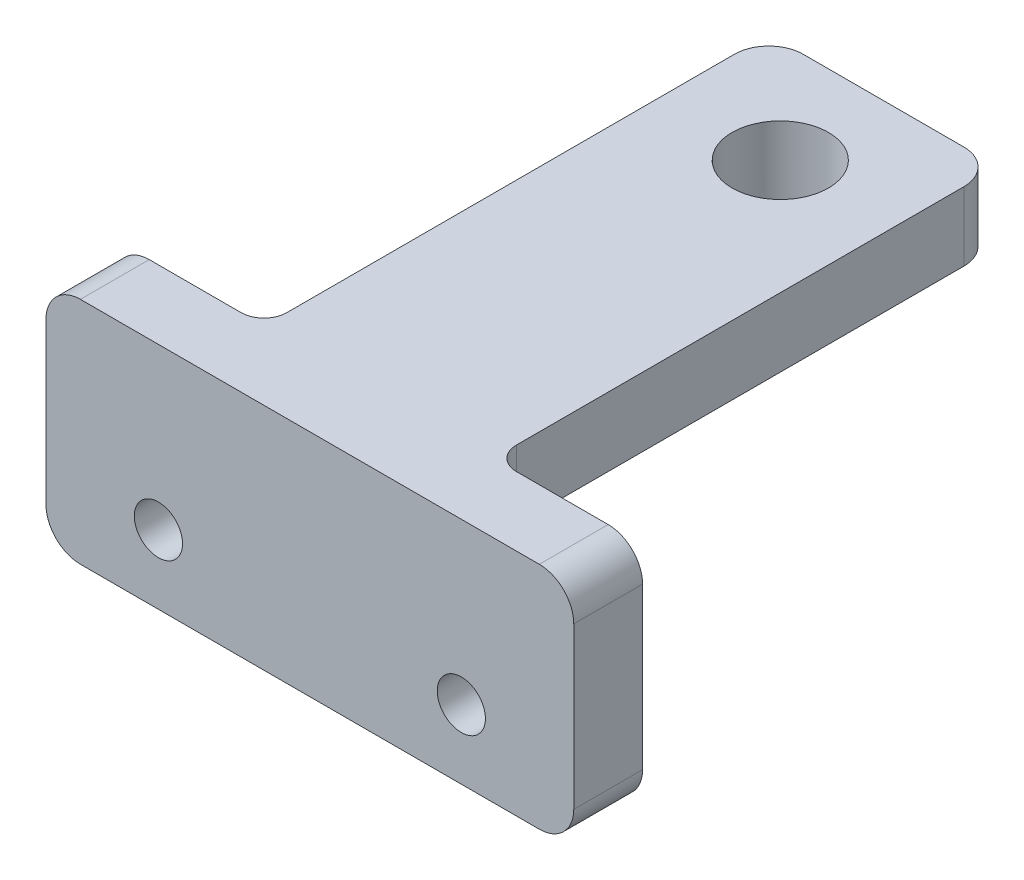
ISO-10303-21;
HEADER;
FILE_DESCRIPTION(('STEP AP214'),'2;1');
FILE_NAME('part.step','',(''),(''),'','','');
FILE_SCHEMA(('AUTOMOTIVE_DESIGN { 1 0 10303 214 1 1 1 1 }'));
ENDSEC;
DATA;
#1=APPLICATION_CONTEXT('core data for automotive mechanical design processes');
#2=APPLICATION_PROTOCOL_DEFINITION('international standard','automotive_design',2000,#1);
#3=PRODUCT_CONTEXT('',#1,'mechanical');
#4=PRODUCT('Part','Part','',(#3));
#5=PRODUCT_RELATED_PRODUCT_CATEGORY('part','',(#4));
#6=PRODUCT_DEFINITION_FORMATION('','',#4);
#7=PRODUCT_DEFINITION_CONTEXT('part definition',#1,'design');
#8=PRODUCT_DEFINITION('design','',#6,#7);
#9=PRODUCT_DEFINITION_SHAPE('','',#8);
#10=(LENGTH_UNIT() NAMED_UNIT(*) SI_UNIT(.MILLI.,.METRE.));
#11=(NAMED_UNIT(*) PLANE_ANGLE_UNIT() SI_UNIT($,.RADIAN.));
#12=(NAMED_UNIT(*) SI_UNIT($,.STERADIAN.) SOLID_ANGLE_UNIT());
#13=UNCERTAINTY_MEASURE_WITH_UNIT(LENGTH_MEASURE(1.E-05),#10,'distance_accuracy_value','');
#14=(GEOMETRIC_REPRESENTATION_CONTEXT(3) GLOBAL_UNCERTAINTY_ASSIGNED_CONTEXT((#13)) GLOBAL_UNIT_ASSIGNED_CONTEXT((#10,
#11,#12)) REPRESENTATION_CONTEXT('',''));
#15=CARTESIAN_POINT('',(0.,0.,0.));
#16=DIRECTION('',(0.,0.,1.));
#17=DIRECTION('',(1.,0.,0.));
#18=AXIS2_PLACEMENT_3D('',#15,#16,#17);
#19=CARTESIAN_POINT('',(0.,0.,3.));
#20=DIRECTION('',(0.,0.,-1.));
#21=DIRECTION('',(-1.,0.,0.));
#22=AXIS2_PLACEMENT_3D('',#19,#20,#21);
#23=PLANE('',#22);
#24=DIRECTION('',(0.,-1.,0.));
#25=VECTOR('',#24,1.);
#26=CARTESIAN_POINT('',(0.,0.,3.));
#27=LINE('',#26,#25);
#28=CARTESIAN_POINT('',(0.,8.5,3.));
#29=VERTEX_POINT('',#28);
#30=CARTESIAN_POINT('',(0.,1.5,3.));
#31=VERTEX_POINT('',#30);
#32=EDGE_CURVE('E194',#29,#31,#27,.T.);
#33=ORIENTED_EDGE('',*,*,#32,.T.);
#34=CARTESIAN_POINT('',(1.5,1.5,3.));
#35=DIRECTION('',(0.,0.,-1.));
#36=DIRECTION('',(-1.,0.,0.));
#37=AXIS2_PLACEMENT_3D('',#34,#35,#36);
#38=CIRCLE('',#37,1.5);
#39=CARTESIAN_POINT('',(1.5,0.,3.));
#40=VERTEX_POINT('',#39);
#41=EDGE_CURVE('E216',#31,#40,#38,.F.);
#42=ORIENTED_EDGE('',*,*,#41,.T.);
#43=DIRECTION('',(1.,0.,0.));
#44=VECTOR('',#43,1.);
#45=CARTESIAN_POINT('',(0.,0.,3.));
#46=LINE('',#45,#44);
#47=CARTESIAN_POINT('',(21.5,0.,3.));
#48=VERTEX_POINT('',#47);
#49=EDGE_CURVE('E174',#40,#48,#46,.T.);
#50=ORIENTED_EDGE('',*,*,#49,.T.);
#51=CARTESIAN_POINT('',(21.5,1.5,3.));
#52=DIRECTION('',(0.,0.,-1.));
#53=DIRECTION('',(-1.,0.,0.));
#54=AXIS2_PLACEMENT_3D('',#51,#52,#53);
#55=CIRCLE('',#54,1.5);
#56=CARTESIAN_POINT('',(23.,1.5,3.));
#57=VERTEX_POINT('',#56);
#58=EDGE_CURVE('E214',#48,#57,#55,.F.);
#59=ORIENTED_EDGE('',*,*,#58,.T.);
#60=DIRECTION('',(0.,1.,0.));
#61=VECTOR('',#60,1.);
#62=CARTESIAN_POINT('',(23.,0.,3.));
#63=LINE('',#62,#61);
#64=CARTESIAN_POINT('',(23.,8.5,3.));
#65=VERTEX_POINT('',#64);
#66=EDGE_CURVE('E298',#57,#65,#63,.T.);
#67=ORIENTED_EDGE('',*,*,#66,.T.);
#68=CARTESIAN_POINT('',(21.5,8.5,3.));
#69=DIRECTION('',(0.,0.,-1.));
#70=DIRECTION('',(-1.,0.,0.));
#71=AXIS2_PLACEMENT_3D('',#68,#69,#70);
#72=CIRCLE('',#71,1.5);
#73=CARTESIAN_POINT('',(21.5,10.,3.));
#74=VERTEX_POINT('',#73);
#75=EDGE_CURVE('E212',#65,#74,#72,.F.);
#76=ORIENTED_EDGE('',*,*,#75,.T.);
#77=DIRECTION('',(-1.,0.,0.));
#78=VECTOR('',#77,1.);
#79=CARTESIAN_POINT('',(0.,10.,3.));
#80=LINE('',#79,#78);
#81=CARTESIAN_POINT('',(1.5,10.,3.));
#82=VERTEX_POINT('',#81);
#83=EDGE_CURVE('E200',#74,#82,#80,.T.);
#84=ORIENTED_EDGE('',*,*,#83,.T.);
#85=CARTESIAN_POINT('',(1.5,8.5,3.));
#86=DIRECTION('',(0.,0.,-1.));
#87=DIRECTION('',(-1.,0.,0.));
#88=AXIS2_PLACEMENT_3D('',#85,#86,#87);
#89=CIRCLE('',#88,1.5);
#90=EDGE_CURVE('E210',#82,#29,#89,.F.);
#91=ORIENTED_EDGE('',*,*,#90,.T.);
#92=EDGE_LOOP('',(#33,#42,#50,#59,#67,#76,#84,#91));
#93=FACE_BOUND('',#92,.T.);
#94=CARTESIAN_POINT('',(4.9,3.,3.));
#95=DIRECTION('',(0.,0.,1.));
#96=DIRECTION('',(1.,0.,0.));
#97=AXIS2_PLACEMENT_3D('',#94,#95,#96);
#98=CIRCLE('',#97,1.05);
#99=CARTESIAN_POINT('',(5.95,3.,3.));
#100=VERTEX_POINT('',#99);
#101=EDGE_CURVE('E188',#100,#100,#98,.T.);
#102=ORIENTED_EDGE('',*,*,#101,.F.);
#103=EDGE_LOOP('',(#102));
#104=FACE_BOUND('',#103,.T.);
#105=CARTESIAN_POINT('',(18.1,3.,3.));
#106=DIRECTION('',(0.,0.,1.));
#107=DIRECTION('',(1.,0.,0.));
#108=AXIS2_PLACEMENT_3D('',#105,#106,#107);
#109=CIRCLE('',#108,1.05);
#110=CARTESIAN_POINT('',(19.15,3.,3.));
#111=VERTEX_POINT('',#110);
#112=EDGE_CURVE('E285',#111,#111,#109,.T.);
#113=ORIENTED_EDGE('',*,*,#112,.F.);
#114=EDGE_LOOP('',(#113));
#115=FACE_BOUND('',#114,.T.);
#116=ADVANCED_FACE('F37',(#93,#104,#115),#23,.F.);
#117=CARTESIAN_POINT('',(0.,0.,0.));
#118=DIRECTION('',(0.,0.,-1.));
#119=DIRECTION('',(-1.,0.,0.));
#120=AXIS2_PLACEMENT_3D('',#117,#118,#119);
#121=PLANE('',#120);
#122=DIRECTION('',(-1.,0.,0.));
#123=VECTOR('',#122,1.);
#124=CARTESIAN_POINT('',(0.,10.,0.));
#125=LINE('',#124,#123);
#126=CARTESIAN_POINT('',(5.5,10.,0.));
#127=VERTEX_POINT('',#126);
#128=CARTESIAN_POINT('',(1.5,10.,0.));
#129=VERTEX_POINT('',#128);
#130=EDGE_CURVE('E186',#127,#129,#125,.T.);
#131=ORIENTED_EDGE('',*,*,#130,.F.);
#132=DIRECTION('',(0.,1.,0.));
#133=VECTOR('',#132,1.);
#134=CARTESIAN_POINT('',(5.5,7.,0.));
#135=LINE('',#134,#133);
#136=CARTESIAN_POINT('',(5.5,6.,0.));
#137=VERTEX_POINT('',#136);
#138=EDGE_CURVE('E253',#127,#137,#135,.F.);
#139=ORIENTED_EDGE('',*,*,#138,.T.);
#140=DIRECTION('',(-1.,0.,0.));
#141=VECTOR('',#140,1.);
#142=CARTESIAN_POINT('',(16.5,6.,0.));
#143=LINE('',#142,#141);
#144=CARTESIAN_POINT('',(17.5,6.,0.));
#145=VERTEX_POINT('',#144);
#146=EDGE_CURVE('E251',#137,#145,#143,.F.);
#147=ORIENTED_EDGE('',*,*,#146,.T.);
#148=DIRECTION('',(0.,-1.,0.));
#149=VECTOR('',#148,1.);
#150=CARTESIAN_POINT('',(17.5,10.,0.));
#151=LINE('',#150,#149);
#152=CARTESIAN_POINT('',(17.5,10.,0.));
#153=VERTEX_POINT('',#152);
#154=EDGE_CURVE('E249',#145,#153,#151,.F.);
#155=ORIENTED_EDGE('',*,*,#154,.T.);
#156=CARTESIAN_POINT('',(21.5,10.,0.));
#157=VERTEX_POINT('',#156);
#158=EDGE_CURVE('E192',#157,#153,#125,.T.);
#159=ORIENTED_EDGE('',*,*,#158,.F.);
#160=CARTESIAN_POINT('',(21.5,8.5,0.));
#161=DIRECTION('',(0.,0.,-1.));
#162=DIRECTION('',(-1.,0.,0.));
#163=AXIS2_PLACEMENT_3D('',#160,#161,#162);
#164=CIRCLE('',#163,1.5);
#165=CARTESIAN_POINT('',(23.,8.5,0.));
#166=VERTEX_POINT('',#165);
#167=EDGE_CURVE('E204',#157,#166,#164,.T.);
#168=ORIENTED_EDGE('',*,*,#167,.T.);
#169=DIRECTION('',(0.,1.,0.));
#170=VECTOR('',#169,1.);
#171=CARTESIAN_POINT('',(23.,0.,0.));
#172=LINE('',#171,#170);
#173=CARTESIAN_POINT('',(23.,1.5,0.));
#174=VERTEX_POINT('',#173);
#175=EDGE_CURVE('E182',#174,#166,#172,.T.);
#176=ORIENTED_EDGE('',*,*,#175,.F.);
#177=CARTESIAN_POINT('',(21.5,1.5,0.));
#178=DIRECTION('',(0.,0.,-1.));
#179=DIRECTION('',(-1.,0.,0.));
#180=AXIS2_PLACEMENT_3D('',#177,#178,#179);
#181=CIRCLE('',#180,1.5);
#182=CARTESIAN_POINT('',(21.5,0.,0.));
#183=VERTEX_POINT('',#182);
#184=EDGE_CURVE('E165',#174,#183,#181,.T.);
#185=ORIENTED_EDGE('',*,*,#184,.T.);
#186=DIRECTION('',(1.,0.,0.));
#187=VECTOR('',#186,1.);
#188=CARTESIAN_POINT('',(0.,0.,0.));
#189=LINE('',#188,#187);
#190=CARTESIAN_POINT('',(1.5,0.,0.));
#191=VERTEX_POINT('',#190);
#192=EDGE_CURVE('E171',#191,#183,#189,.T.);
#193=ORIENTED_EDGE('',*,*,#192,.F.);
#194=CARTESIAN_POINT('',(1.5,1.5,0.));
#195=DIRECTION('',(0.,0.,-1.));
#196=DIRECTION('',(-1.,0.,0.));
#197=AXIS2_PLACEMENT_3D('',#194,#195,#196);
#198=CIRCLE('',#197,1.5);
#199=CARTESIAN_POINT('',(0.,1.5,0.));
#200=VERTEX_POINT('',#199);
#201=EDGE_CURVE('E154',#191,#200,#198,.T.);
#202=ORIENTED_EDGE('',*,*,#201,.T.);
#203=DIRECTION('',(0.,-1.,0.));
#204=VECTOR('',#203,1.);
#205=CARTESIAN_POINT('',(0.,0.,0.));
#206=LINE('',#205,#204);
#207=CARTESIAN_POINT('',(0.,8.5,0.));
#208=VERTEX_POINT('',#207);
#209=EDGE_CURVE('E183',#208,#200,#206,.T.);
#210=ORIENTED_EDGE('',*,*,#209,.F.);
#211=CARTESIAN_POINT('',(1.5,8.5,0.));
#212=DIRECTION('',(0.,0.,-1.));
#213=DIRECTION('',(-1.,0.,0.));
#214=AXIS2_PLACEMENT_3D('',#211,#212,#213);
#215=CIRCLE('',#214,1.5);
#216=EDGE_CURVE('E175',#208,#129,#215,.T.);
#217=ORIENTED_EDGE('',*,*,#216,.T.);
#218=EDGE_LOOP('',(#131,#139,#147,#155,#159,#168,#176,#185,#193,#202,#210,#217));
#219=FACE_BOUND('',#218,.T.);
#220=CARTESIAN_POINT('',(4.9,3.,0.));
#221=DIRECTION('',(0.,0.,1.));
#222=DIRECTION('',(1.,0.,0.));
#223=AXIS2_PLACEMENT_3D('',#220,#221,#222);
#224=CIRCLE('',#223,1.05);
#225=CARTESIAN_POINT('',(5.95,3.,0.));
#226=VERTEX_POINT('',#225);
#227=EDGE_CURVE('E288',#226,#226,#224,.T.);
#228=ORIENTED_EDGE('',*,*,#227,.T.);
#229=EDGE_LOOP('',(#228));
#230=FACE_BOUND('',#229,.T.);
#231=CARTESIAN_POINT('',(18.1,3.,0.));
#232=DIRECTION('',(0.,0.,1.));
#233=DIRECTION('',(1.,0.,0.));
#234=AXIS2_PLACEMENT_3D('',#231,#232,#233);
#235=CIRCLE('',#234,1.05);
#236=CARTESIAN_POINT('',(19.15,3.,0.));
#237=VERTEX_POINT('',#236);
#238=EDGE_CURVE('E278',#237,#237,#235,.T.);
#239=ORIENTED_EDGE('',*,*,#238,.T.);
#240=EDGE_LOOP('',(#239));
#241=FACE_BOUND('',#240,.T.);
#242=ADVANCED_FACE('F179',(#219,#230,#241),#121,.T.);
#243=CARTESIAN_POINT('',(0.,0.,3.));
#244=DIRECTION('',(1.,0.,0.));
#245=DIRECTION('',(0.,0.,-1.));
#246=AXIS2_PLACEMENT_3D('',#243,#244,#245);
#247=PLANE('',#246);
#248=ORIENTED_EDGE('',*,*,#209,.T.);
#249=DIRECTION('',(0.,0.,-1.));
#250=VECTOR('',#249,1.);
#251=CARTESIAN_POINT('',(0.,1.5,3.));
#252=LINE('',#251,#250);
#253=EDGE_CURVE('E159',#200,#31,#252,.F.);
#254=ORIENTED_EDGE('',*,*,#253,.T.);
#255=ORIENTED_EDGE('',*,*,#32,.F.);
#256=DIRECTION('',(0.,0.,-1.));
#257=VECTOR('',#256,1.);
#258=CARTESIAN_POINT('',(0.,8.5,3.));
#259=LINE('',#258,#257);
#260=EDGE_CURVE('E164',#29,#208,#259,.T.);
#261=ORIENTED_EDGE('',*,*,#260,.T.);
#262=EDGE_LOOP('',(#248,#254,#255,#261));
#263=FACE_BOUND('',#262,.T.);
#264=ADVANCED_FACE('F313',(#263),#247,.F.);
#265=CARTESIAN_POINT('',(0.,0.,3.));
#266=DIRECTION('',(0.,1.,0.));
#267=DIRECTION('',(0.,0.,1.));
#268=AXIS2_PLACEMENT_3D('',#265,#266,#267);
#269=PLANE('',#268);
#270=ORIENTED_EDGE('',*,*,#49,.F.);
#271=DIRECTION('',(0.,0.,-1.));
#272=VECTOR('',#271,1.);
#273=CARTESIAN_POINT('',(1.5,0.,3.));
#274=LINE('',#273,#272);
#275=EDGE_CURVE('E158',#40,#191,#274,.T.);
#276=ORIENTED_EDGE('',*,*,#275,.T.);
#277=ORIENTED_EDGE('',*,*,#192,.T.);
#278=DIRECTION('',(0.,0.,-1.));
#279=VECTOR('',#278,1.);
#280=CARTESIAN_POINT('',(21.5,0.,3.));
#281=LINE('',#280,#279);
#282=EDGE_CURVE('E176',#183,#48,#281,.F.);
#283=ORIENTED_EDGE('',*,*,#282,.T.);
#284=EDGE_LOOP('',(#270,#276,#277,#283));
#285=FACE_BOUND('',#284,.T.);
#286=ADVANCED_FACE('F170',(#285),#269,.F.);
#287=CARTESIAN_POINT('',(23.,0.,3.));
#288=DIRECTION('',(-1.,0.,0.));
#289=DIRECTION('',(0.,0.,1.));
#290=AXIS2_PLACEMENT_3D('',#287,#288,#289);
#291=PLANE('',#290);
#292=ORIENTED_EDGE('',*,*,#66,.F.);
#293=DIRECTION('',(0.,0.,-1.));
#294=VECTOR('',#293,1.);
#295=CARTESIAN_POINT('',(23.,1.5,3.));
#296=LINE('',#295,#294);
#297=EDGE_CURVE('E220',#57,#174,#296,.T.);
#298=ORIENTED_EDGE('',*,*,#297,.T.);
#299=ORIENTED_EDGE('',*,*,#175,.T.);
#300=DIRECTION('',(0.,0.,-1.));
#301=VECTOR('',#300,1.);
#302=CARTESIAN_POINT('',(23.,8.5,3.));
#303=LINE('',#302,#301);
#304=EDGE_CURVE('E218',#166,#65,#303,.F.);
#305=ORIENTED_EDGE('',*,*,#304,.T.);
#306=EDGE_LOOP('',(#292,#298,#299,#305));
#307=FACE_BOUND('',#306,.T.);
#308=ADVANCED_FACE('F349',(#307),#291,.F.);
#309=CARTESIAN_POINT('',(0.,10.,3.));
#310=DIRECTION('',(0.,-1.,0.));
#311=DIRECTION('',(0.,0.,-1.));
#312=AXIS2_PLACEMENT_3D('',#309,#310,#311);
#313=PLANE('',#312);
#314=CARTESIAN_POINT('',(11.5,10.,-17.5));
#315=DIRECTION('',(0.,1.,0.));
#316=DIRECTION('',(0.,0.,1.));
#317=AXIS2_PLACEMENT_3D('',#314,#315,#316);
#318=CIRCLE('',#317,2.1);
#319=CARTESIAN_POINT('',(11.5,10.,-15.4));
#320=VERTEX_POINT('',#319);
#321=EDGE_CURVE('E199',#320,#320,#318,.T.);
#322=ORIENTED_EDGE('',*,*,#321,.F.);
#323=EDGE_LOOP('',(#322));
#324=FACE_BOUND('',#323,.T.);
#325=ORIENTED_EDGE('',*,*,#83,.F.);
#326=DIRECTION('',(0.,0.,-1.));
#327=VECTOR('',#326,1.);
#328=CARTESIAN_POINT('',(21.5,10.,3.));
#329=LINE('',#328,#327);
#330=EDGE_CURVE('E229',#74,#157,#329,.T.);
#331=ORIENTED_EDGE('',*,*,#330,.T.);
#332=ORIENTED_EDGE('',*,*,#158,.T.);
#333=CARTESIAN_POINT('',(17.5,10.,-1.));
#334=DIRECTION('',(0.,-1.,0.));
#335=DIRECTION('',(0.,0.,-1.));
#336=AXIS2_PLACEMENT_3D('',#333,#334,#335);
#337=CIRCLE('',#336,1.);
#338=CARTESIAN_POINT('',(16.5,10.,-1.));
#339=VERTEX_POINT('',#338);
#340=EDGE_CURVE('E11',#153,#339,#337,.T.);
#341=ORIENTED_EDGE('',*,*,#340,.T.);
#342=DIRECTION('',(0.,0.,1.));
#343=VECTOR('',#342,1.);
#344=CARTESIAN_POINT('',(16.5,10.,-22.));
#345=LINE('',#344,#343);
#346=CARTESIAN_POINT('',(16.5,10.,-20.5));
#347=VERTEX_POINT('',#346);
#348=EDGE_CURVE('E279',#347,#339,#345,.T.);
#349=ORIENTED_EDGE('',*,*,#348,.F.);
#350=CARTESIAN_POINT('',(15.,10.,-20.5));
#351=DIRECTION('',(0.,-1.,0.));
#352=DIRECTION('',(0.,0.,-1.));
#353=AXIS2_PLACEMENT_3D('',#350,#351,#352);
#354=CIRCLE('',#353,1.5);
#355=CARTESIAN_POINT('',(15.,10.,-22.));
#356=VERTEX_POINT('',#355);
#357=EDGE_CURVE('E223',#347,#356,#354,.F.);
#358=ORIENTED_EDGE('',*,*,#357,.T.);
#359=DIRECTION('',(-1.,0.,0.));
#360=VECTOR('',#359,1.);
#361=CARTESIAN_POINT('',(6.5,10.,-22.));
#362=LINE('',#361,#360);
#363=CARTESIAN_POINT('',(8.,10.,-22.));
#364=VERTEX_POINT('',#363);
#365=EDGE_CURVE('E272',#356,#364,#362,.T.);
#366=ORIENTED_EDGE('',*,*,#365,.T.);
#367=CARTESIAN_POINT('',(8.,10.,-20.5));
#368=DIRECTION('',(0.,-1.,0.));
#369=DIRECTION('',(0.,0.,-1.));
#370=AXIS2_PLACEMENT_3D('',#367,#368,#369);
#371=CIRCLE('',#370,1.5);
#372=CARTESIAN_POINT('',(6.5,10.,-20.5));
#373=VERTEX_POINT('',#372);
#374=EDGE_CURVE('E225',#364,#373,#371,.F.);
#375=ORIENTED_EDGE('',*,*,#374,.T.);
#376=DIRECTION('',(0.,0.,1.));
#377=VECTOR('',#376,1.);
#378=CARTESIAN_POINT('',(6.5,10.,-22.));
#379=LINE('',#378,#377);
#380=CARTESIAN_POINT('',(6.5,10.,-1.));
#381=VERTEX_POINT('',#380);
#382=EDGE_CURVE('E276',#373,#381,#379,.T.);
#383=ORIENTED_EDGE('',*,*,#382,.T.);
#384=CARTESIAN_POINT('',(5.5,10.,-1.));
#385=DIRECTION('',(0.,-1.,0.));
#386=DIRECTION('',(0.,0.,-1.));
#387=AXIS2_PLACEMENT_3D('',#384,#385,#386);
#388=CIRCLE('',#387,1.);
#389=EDGE_CURVE('E46',#381,#127,#388,.T.);
#390=ORIENTED_EDGE('',*,*,#389,.T.);
#391=ORIENTED_EDGE('',*,*,#130,.T.);
#392=DIRECTION('',(0.,0.,-1.));
#393=VECTOR('',#392,1.);
#394=CARTESIAN_POINT('',(1.5,10.,3.));
#395=LINE('',#394,#393);
#396=EDGE_CURVE('E227',#129,#82,#395,.F.);
#397=ORIENTED_EDGE('',*,*,#396,.T.);
#398=EDGE_LOOP('',(#325,#331,#332,#341,#349,#358,#366,#375,#383,#390,#391,#397));
#399=FACE_BOUND('',#398,.T.);
#400=ADVANCED_FACE('F343',(#324,#399),#313,.F.);
#401=CARTESIAN_POINT('',(4.9,3.,3.));
#402=DIRECTION('',(0.,0.,-1.));
#403=DIRECTION('',(-1.,0.,0.));
#404=AXIS2_PLACEMENT_3D('',#401,#402,#403);
#405=CYLINDRICAL_SURFACE('',#404,1.05);
#406=ORIENTED_EDGE('',*,*,#101,.T.);
#407=EDGE_LOOP('',(#406));
#408=FACE_BOUND('',#407,.T.);
#409=ORIENTED_EDGE('',*,*,#227,.F.);
#410=EDGE_LOOP('',(#409));
#411=FACE_BOUND('',#410,.T.);
#412=ADVANCED_FACE('F370',(#408,#411),#405,.F.);
#413=CARTESIAN_POINT('',(18.1,3.,3.));
#414=DIRECTION('',(0.,0.,-1.));
#415=DIRECTION('',(-1.,0.,0.));
#416=AXIS2_PLACEMENT_3D('',#413,#414,#415);
#417=CYLINDRICAL_SURFACE('',#416,1.05);
#418=ORIENTED_EDGE('',*,*,#112,.T.);
#419=EDGE_LOOP('',(#418));
#420=FACE_BOUND('',#419,.T.);
#421=ORIENTED_EDGE('',*,*,#238,.F.);
#422=EDGE_LOOP('',(#421));
#423=FACE_BOUND('',#422,.T.);
#424=ADVANCED_FACE('F405',(#420,#423),#417,.F.);
#425=CARTESIAN_POINT('',(6.5,10.,-22.));
#426=DIRECTION('',(-1.,0.,0.));
#427=DIRECTION('',(0.,-1.,0.));
#428=AXIS2_PLACEMENT_3D('',#425,#426,#427);
#429=PLANE('',#428);
#430=DIRECTION('',(0.,0.,1.));
#431=VECTOR('',#430,1.);
#432=CARTESIAN_POINT('',(6.5,7.,-22.));
#433=LINE('',#432,#431);
#434=CARTESIAN_POINT('',(6.5,7.,-20.5));
#435=VERTEX_POINT('',#434);
#436=CARTESIAN_POINT('',(6.5,7.,-1.));
#437=VERTEX_POINT('',#436);
#438=EDGE_CURVE('E275',#435,#437,#433,.T.);
#439=ORIENTED_EDGE('',*,*,#438,.T.);
#440=DIRECTION('',(0.,1.,0.));
#441=VECTOR('',#440,1.);
#442=CARTESIAN_POINT('',(6.5,10.,-1.));
#443=LINE('',#442,#441);
#444=EDGE_CURVE('E60',#437,#381,#443,.T.);
#445=ORIENTED_EDGE('',*,*,#444,.T.);
#446=ORIENTED_EDGE('',*,*,#382,.F.);
#447=DIRECTION('',(0.,-1.,0.));
#448=VECTOR('',#447,1.);
#449=CARTESIAN_POINT('',(6.5,7.,-20.5));
#450=LINE('',#449,#448);
#451=EDGE_CURVE('E232',#373,#435,#450,.T.);
#452=ORIENTED_EDGE('',*,*,#451,.T.);
#453=EDGE_LOOP('',(#439,#445,#446,#452));
#454=FACE_BOUND('',#453,.T.);
#455=ADVANCED_FACE('F322',(#454),#429,.T.);
#456=CARTESIAN_POINT('',(16.5,10.,-22.));
#457=DIRECTION('',(1.,0.,0.));
#458=DIRECTION('',(0.,0.,-1.));
#459=AXIS2_PLACEMENT_3D('',#456,#457,#458);
#460=PLANE('',#459);
#461=ORIENTED_EDGE('',*,*,#348,.T.);
#462=DIRECTION('',(0.,-1.,0.));
#463=VECTOR('',#462,1.);
#464=CARTESIAN_POINT('',(16.5,7.,-1.));
#465=LINE('',#464,#463);
#466=CARTESIAN_POINT('',(16.5,7.,-1.));
#467=VERTEX_POINT('',#466);
#468=EDGE_CURVE('E256',#339,#467,#465,.T.);
#469=ORIENTED_EDGE('',*,*,#468,.T.);
#470=DIRECTION('',(0.,0.,1.));
#471=VECTOR('',#470,1.);
#472=CARTESIAN_POINT('',(16.5,7.,-22.));
#473=LINE('',#472,#471);
#474=CARTESIAN_POINT('',(16.5,7.,-20.5));
#475=VERTEX_POINT('',#474);
#476=EDGE_CURVE('E281',#475,#467,#473,.T.);
#477=ORIENTED_EDGE('',*,*,#476,.F.);
#478=DIRECTION('',(0.,1.,0.));
#479=VECTOR('',#478,1.);
#480=CARTESIAN_POINT('',(16.5,10.,-20.5));
#481=LINE('',#480,#479);
#482=EDGE_CURVE('E243',#475,#347,#481,.T.);
#483=ORIENTED_EDGE('',*,*,#482,.T.);
#484=EDGE_LOOP('',(#461,#469,#477,#483));
#485=FACE_BOUND('',#484,.T.);
#486=ADVANCED_FACE('F338',(#485),#460,.T.);
#487=CARTESIAN_POINT('',(6.5,7.,-22.));
#488=DIRECTION('',(0.,-1.,0.));
#489=DIRECTION('',(1.,0.,0.));
#490=AXIS2_PLACEMENT_3D('',#487,#488,#489);
#491=PLANE('',#490);
#492=CARTESIAN_POINT('',(11.5,7.,-17.5));
#493=DIRECTION('',(0.,-1.,0.));
#494=DIRECTION('',(1.,0.,0.));
#495=AXIS2_PLACEMENT_3D('',#492,#493,#494);
#496=CIRCLE('',#495,2.1);
#497=CARTESIAN_POINT('',(13.6,7.,-17.5));
#498=VERTEX_POINT('',#497);
#499=EDGE_CURVE('E195',#498,#498,#496,.T.);
#500=ORIENTED_EDGE('',*,*,#499,.F.);
#501=EDGE_LOOP('',(#500));
#502=FACE_BOUND('',#501,.T.);
#503=ORIENTED_EDGE('',*,*,#476,.T.);
#504=DIRECTION('',(-1.,0.,0.));
#505=VECTOR('',#504,1.);
#506=CARTESIAN_POINT('',(6.5,7.,-1.));
#507=LINE('',#506,#505);
#508=EDGE_CURVE('E246',#467,#437,#507,.T.);
#509=ORIENTED_EDGE('',*,*,#508,.T.);
#510=ORIENTED_EDGE('',*,*,#438,.F.);
#511=CARTESIAN_POINT('',(8.,7.,-20.5));
#512=DIRECTION('',(0.,-1.,0.));
#513=DIRECTION('',(1.,0.,0.));
#514=AXIS2_PLACEMENT_3D('',#511,#512,#513);
#515=CIRCLE('',#514,1.5);
#516=CARTESIAN_POINT('',(8.,7.,-22.));
#517=VERTEX_POINT('',#516);
#518=EDGE_CURVE('E237',#435,#517,#515,.T.);
#519=ORIENTED_EDGE('',*,*,#518,.T.);
#520=DIRECTION('',(1.,0.,0.));
#521=VECTOR('',#520,1.);
#522=CARTESIAN_POINT('',(6.5,7.,-22.));
#523=LINE('',#522,#521);
#524=CARTESIAN_POINT('',(15.,7.,-22.));
#525=VERTEX_POINT('',#524);
#526=EDGE_CURVE('E198',#517,#525,#523,.T.);
#527=ORIENTED_EDGE('',*,*,#526,.T.);
#528=CARTESIAN_POINT('',(15.,7.,-20.5));
#529=DIRECTION('',(0.,-1.,0.));
#530=DIRECTION('',(1.,0.,0.));
#531=AXIS2_PLACEMENT_3D('',#528,#529,#530);
#532=CIRCLE('',#531,1.5);
#533=EDGE_CURVE('E235',#525,#475,#532,.T.);
#534=ORIENTED_EDGE('',*,*,#533,.T.);
#535=EDGE_LOOP('',(#503,#509,#510,#519,#527,#534));
#536=FACE_BOUND('',#535,.T.);
#537=ADVANCED_FACE('F320',(#502,#536),#491,.T.);
#538=CARTESIAN_POINT('',(0.,0.,-22.));
#539=DIRECTION('',(0.,0.,1.));
#540=DIRECTION('',(1.,0.,0.));
#541=AXIS2_PLACEMENT_3D('',#538,#539,#540);
#542=PLANE('',#541);
#543=ORIENTED_EDGE('',*,*,#526,.F.);
#544=DIRECTION('',(0.,-1.,0.));
#545=VECTOR('',#544,1.);
#546=CARTESIAN_POINT('',(8.,10.,-22.));
#547=LINE('',#546,#545);
#548=EDGE_CURVE('E241',#517,#364,#547,.F.);
#549=ORIENTED_EDGE('',*,*,#548,.T.);
#550=ORIENTED_EDGE('',*,*,#365,.F.);
#551=DIRECTION('',(0.,1.,0.));
#552=VECTOR('',#551,1.);
#553=CARTESIAN_POINT('',(15.,7.,-22.));
#554=LINE('',#553,#552);
#555=EDGE_CURVE('E239',#356,#525,#554,.F.);
#556=ORIENTED_EDGE('',*,*,#555,.T.);
#557=EDGE_LOOP('',(#543,#549,#550,#556));
#558=FACE_BOUND('',#557,.T.);
#559=ADVANCED_FACE('F331',(#558),#542,.F.);
#560=CARTESIAN_POINT('',(11.5,0.,-17.5));
#561=DIRECTION('',(0.,1.,0.));
#562=DIRECTION('',(0.,0.,1.));
#563=AXIS2_PLACEMENT_3D('',#560,#561,#562);
#564=CYLINDRICAL_SURFACE('',#563,2.1);
#565=ORIENTED_EDGE('',*,*,#499,.T.);
#566=EDGE_LOOP('',(#565));
#567=FACE_BOUND('',#566,.T.);
#568=ORIENTED_EDGE('',*,*,#321,.T.);
#569=EDGE_LOOP('',(#568));
#570=FACE_BOUND('',#569,.T.);
#571=ADVANCED_FACE('F361',(#567,#570),#564,.F.);
#572=CARTESIAN_POINT('',(1.5,1.5,3.));
#573=DIRECTION('',(0.,0.,-1.));
#574=DIRECTION('',(-1.,0.,0.));
#575=AXIS2_PLACEMENT_3D('',#572,#573,#574);
#576=CYLINDRICAL_SURFACE('',#575,1.5);
#577=ORIENTED_EDGE('',*,*,#41,.F.);
#578=ORIENTED_EDGE('',*,*,#253,.F.);
#579=ORIENTED_EDGE('',*,*,#201,.F.);
#580=ORIENTED_EDGE('',*,*,#275,.F.);
#581=EDGE_LOOP('',(#577,#578,#579,#580));
#582=FACE_BOUND('',#581,.T.);
#583=ADVANCED_FACE('F157',(#582),#576,.T.);
#584=CARTESIAN_POINT('',(21.5,1.5,3.));
#585=DIRECTION('',(0.,0.,-1.));
#586=DIRECTION('',(-1.,0.,0.));
#587=AXIS2_PLACEMENT_3D('',#584,#585,#586);
#588=CYLINDRICAL_SURFACE('',#587,1.5);
#589=ORIENTED_EDGE('',*,*,#58,.F.);
#590=ORIENTED_EDGE('',*,*,#282,.F.);
#591=ORIENTED_EDGE('',*,*,#184,.F.);
#592=ORIENTED_EDGE('',*,*,#297,.F.);
#593=EDGE_LOOP('',(#589,#590,#591,#592));
#594=FACE_BOUND('',#593,.T.);
#595=ADVANCED_FACE('F353',(#594),#588,.T.);
#596=CARTESIAN_POINT('',(21.5,8.5,3.));
#597=DIRECTION('',(0.,0.,-1.));
#598=DIRECTION('',(-1.,0.,0.));
#599=AXIS2_PLACEMENT_3D('',#596,#597,#598);
#600=CYLINDRICAL_SURFACE('',#599,1.5);
#601=ORIENTED_EDGE('',*,*,#75,.F.);
#602=ORIENTED_EDGE('',*,*,#304,.F.);
#603=ORIENTED_EDGE('',*,*,#167,.F.);
#604=ORIENTED_EDGE('',*,*,#330,.F.);
#605=EDGE_LOOP('',(#601,#602,#603,#604));
#606=FACE_BOUND('',#605,.T.);
#607=ADVANCED_FACE('F345',(#606),#600,.T.);
#608=CARTESIAN_POINT('',(1.5,8.5,3.));
#609=DIRECTION('',(0.,0.,-1.));
#610=DIRECTION('',(-1.,0.,0.));
#611=AXIS2_PLACEMENT_3D('',#608,#609,#610);
#612=CYLINDRICAL_SURFACE('',#611,1.5);
#613=ORIENTED_EDGE('',*,*,#90,.F.);
#614=ORIENTED_EDGE('',*,*,#396,.F.);
#615=ORIENTED_EDGE('',*,*,#216,.F.);
#616=ORIENTED_EDGE('',*,*,#260,.F.);
#617=EDGE_LOOP('',(#613,#614,#615,#616));
#618=FACE_BOUND('',#617,.T.);
#619=ADVANCED_FACE('F311',(#618),#612,.T.);
#620=CARTESIAN_POINT('',(8.,10.,-20.5));
#621=DIRECTION('',(0.,1.,0.));
#622=DIRECTION('',(-1.,0.,0.));
#623=AXIS2_PLACEMENT_3D('',#620,#621,#622);
#624=CYLINDRICAL_SURFACE('',#623,1.5);
#625=ORIENTED_EDGE('',*,*,#374,.F.);
#626=ORIENTED_EDGE('',*,*,#548,.F.);
#627=ORIENTED_EDGE('',*,*,#518,.F.);
#628=ORIENTED_EDGE('',*,*,#451,.F.);
#629=EDGE_LOOP('',(#625,#626,#627,#628));
#630=FACE_BOUND('',#629,.T.);
#631=ADVANCED_FACE('F326',(#630),#624,.T.);
#632=CARTESIAN_POINT('',(15.,10.,-20.5));
#633=DIRECTION('',(0.,-1.,0.));
#634=DIRECTION('',(0.,0.,-1.));
#635=AXIS2_PLACEMENT_3D('',#632,#633,#634);
#636=CYLINDRICAL_SURFACE('',#635,1.5);
#637=ORIENTED_EDGE('',*,*,#533,.F.);
#638=ORIENTED_EDGE('',*,*,#555,.F.);
#639=ORIENTED_EDGE('',*,*,#357,.F.);
#640=ORIENTED_EDGE('',*,*,#482,.F.);
#641=EDGE_LOOP('',(#637,#638,#639,#640));
#642=FACE_BOUND('',#641,.T.);
#643=ADVANCED_FACE('F335',(#642),#636,.T.);
#644=CARTESIAN_POINT('',(17.5,10.,-1.));
#645=DIRECTION('',(0.,1.,0.));
#646=DIRECTION('',(0.,0.,1.));
#647=AXIS2_PLACEMENT_3D('',#644,#645,#646);
#648=CYLINDRICAL_SURFACE('',#647,1.);
#649=ORIENTED_EDGE('',*,*,#340,.F.);
#650=ORIENTED_EDGE('',*,*,#154,.F.);
#651=CARTESIAN_POINT('',(17.5,6.,-1.));
#652=DIRECTION('',(0.707106781186547,0.707106781186548,0.));
#653=DIRECTION('',(-0.707106781186548,0.707106781186547,0.));
#654=AXIS2_PLACEMENT_3D('',#651,#652,#653);
#655=ELLIPSE('',#654,1.41421356237309,1.);
#656=EDGE_CURVE('E41',#467,#145,#655,.T.);
#657=ORIENTED_EDGE('',*,*,#656,.F.);
#658=ORIENTED_EDGE('',*,*,#468,.F.);
#659=EDGE_LOOP('',(#649,#650,#657,#658));
#660=FACE_BOUND('',#659,.T.);
#661=ADVANCED_FACE('F39',(#660),#648,.F.);
#662=CARTESIAN_POINT('',(5.5,10.,-1.));
#663=DIRECTION('',(0.,-1.,0.));
#664=DIRECTION('',(1.,0.,0.));
#665=AXIS2_PLACEMENT_3D('',#662,#663,#664);
#666=CYLINDRICAL_SURFACE('',#665,1.);
#667=ORIENTED_EDGE('',*,*,#389,.F.);
#668=ORIENTED_EDGE('',*,*,#444,.F.);
#669=CARTESIAN_POINT('',(5.5,6.,-1.));
#670=DIRECTION('',(0.707106781186548,-0.707106781186547,0.));
#671=DIRECTION('',(-0.707106781186547,-0.707106781186548,0.));
#672=AXIS2_PLACEMENT_3D('',#669,#670,#671);
#673=ELLIPSE('',#672,1.41421356237309,1.);
#674=EDGE_CURVE('E258',#137,#437,#673,.F.);
#675=ORIENTED_EDGE('',*,*,#674,.F.);
#676=ORIENTED_EDGE('',*,*,#138,.F.);
#677=EDGE_LOOP('',(#667,#668,#675,#676));
#678=FACE_BOUND('',#677,.T.);
#679=ADVANCED_FACE('F317',(#678),#666,.F.);
#680=CARTESIAN_POINT('',(6.5,6.,-1.));
#681=DIRECTION('',(1.,0.,0.));
#682=DIRECTION('',(0.,1.,0.));
#683=AXIS2_PLACEMENT_3D('',#680,#681,#682);
#684=CYLINDRICAL_SURFACE('',#683,1.);
#685=ORIENTED_EDGE('',*,*,#656,.T.);
#686=ORIENTED_EDGE('',*,*,#146,.F.);
#687=ORIENTED_EDGE('',*,*,#674,.T.);
#688=ORIENTED_EDGE('',*,*,#508,.F.);
#689=EDGE_LOOP('',(#685,#686,#687,#688));
#690=FACE_BOUND('',#689,.T.);
#691=ADVANCED_FACE('F565',(#690),#684,.F.);
#692=CLOSED_SHELL('',(#116,#242,#264,#286,#308,#400,#412,#424,#455,#486,#537,#559,#571,#583,
#595,#607,#619,#631,#643,#661,#679,#691));
#693=MANIFOLD_SOLID_BREP('B2',#692);
#694=ADVANCED_BREP_SHAPE_REPRESENTATION('',(#18,#693),#14);
#695=SHAPE_DEFINITION_REPRESENTATION(#9,#694);
ENDSEC;
END-ISO-10303-21;
